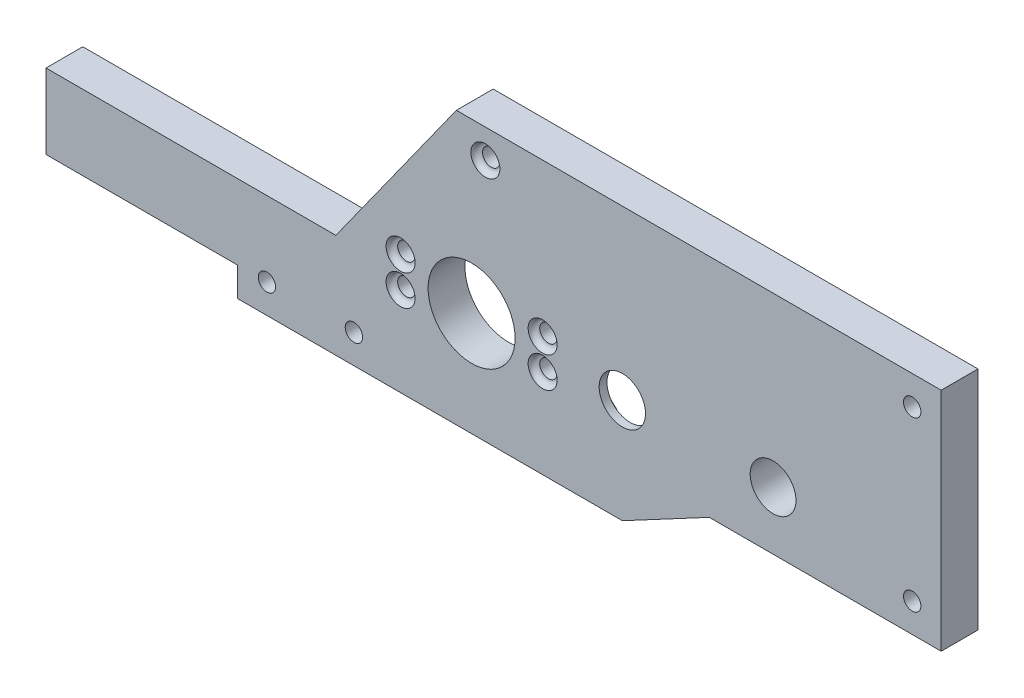
ISO-10303-21;
HEADER;
FILE_DESCRIPTION(('STEP AP214'),'2;1');
FILE_NAME('part.step','',(''),(''),'','','');
FILE_SCHEMA(('AUTOMOTIVE_DESIGN { 1 0 10303 214 1 1 1 1 }'));
ENDSEC;
DATA;
#1=APPLICATION_CONTEXT('core data for automotive mechanical design processes');
#2=APPLICATION_PROTOCOL_DEFINITION('international standard','automotive_design',2000,#1);
#3=PRODUCT_CONTEXT('',#1,'mechanical');
#4=PRODUCT('Part','Part','',(#3));
#5=PRODUCT_RELATED_PRODUCT_CATEGORY('part','',(#4));
#6=PRODUCT_DEFINITION_FORMATION('','',#4);
#7=PRODUCT_DEFINITION_CONTEXT('part definition',#1,'design');
#8=PRODUCT_DEFINITION('design','',#6,#7);
#9=PRODUCT_DEFINITION_SHAPE('','',#8);
#10=(LENGTH_UNIT() NAMED_UNIT(*) SI_UNIT(.MILLI.,.METRE.));
#11=(NAMED_UNIT(*) PLANE_ANGLE_UNIT() SI_UNIT($,.RADIAN.));
#12=(NAMED_UNIT(*) SI_UNIT($,.STERADIAN.) SOLID_ANGLE_UNIT());
#13=UNCERTAINTY_MEASURE_WITH_UNIT(LENGTH_MEASURE(1.E-05),#10,'distance_accuracy_value','');
#14=(GEOMETRIC_REPRESENTATION_CONTEXT(3) GLOBAL_UNCERTAINTY_ASSIGNED_CONTEXT((#13)) GLOBAL_UNIT_ASSIGNED_CONTEXT((#10,
#11,#12)) REPRESENTATION_CONTEXT('',''));
#15=CARTESIAN_POINT('',(0.,0.,0.));
#16=DIRECTION('',(0.,0.,1.));
#17=DIRECTION('',(1.,0.,0.));
#18=AXIS2_PLACEMENT_3D('',#15,#16,#17);
#19=CARTESIAN_POINT('',(0.,0.,6.35));
#20=DIRECTION('',(0.,0.,-1.));
#21=DIRECTION('',(-1.,0.,0.));
#22=AXIS2_PLACEMENT_3D('',#19,#20,#21);
#23=PLANE('',#22);
#24=CARTESIAN_POINT('',(54.2345719771094,0.778451522678827,6.35));
#25=DIRECTION('',(0.,0.,-1.));
#26=DIRECTION('',(-1.,0.,0.));
#27=AXIS2_PLACEMENT_3D('',#24,#25,#26);
#28=CIRCLE('',#27,4.00000000000001);
#29=CARTESIAN_POINT('',(50.2345719771094,0.778451522678827,6.35));
#30=VERTEX_POINT('',#29);
#31=EDGE_CURVE('E374',#30,#30,#28,.F.);
#32=ORIENTED_EDGE('',*,*,#31,.F.);
#33=EDGE_LOOP('',(#32));
#34=FACE_BOUND('',#33,.T.);
#35=CARTESIAN_POINT('',(30.6108482559838,24.7784515226788,6.35));
#36=DIRECTION('',(0.,0.,-1.));
#37=DIRECTION('',(-1.,0.,0.));
#38=AXIS2_PLACEMENT_3D('',#35,#36,#37);
#39=CIRCLE('',#38,2.5);
#40=CARTESIAN_POINT('',(33.1108482559838,24.7784515226788,6.35));
#41=VERTEX_POINT('',#40);
#42=EDGE_CURVE('E369',#41,#41,#39,.T.);
#43=ORIENTED_EDGE('',*,*,#42,.T.);
#44=EDGE_LOOP('',(#43));
#45=FACE_BOUND('',#44,.T.);
#46=CARTESIAN_POINT('',(40.4845719771094,-1.87154847732117,6.35));
#47=DIRECTION('',(0.,0.,-1.));
#48=DIRECTION('',(-1.,0.,0.));
#49=AXIS2_PLACEMENT_3D('',#46,#47,#48);
#50=CIRCLE('',#49,2.5);
#51=CARTESIAN_POINT('',(37.9845719771095,-1.87154847732117,6.35));
#52=VERTEX_POINT('',#51);
#53=EDGE_CURVE('E364',#52,#52,#50,.T.);
#54=ORIENTED_EDGE('',*,*,#53,.T.);
#55=EDGE_LOOP('',(#54));
#56=FACE_BOUND('',#55,.T.);
#57=CARTESIAN_POINT('',(40.4845719771094,3.42845152267883,6.35));
#58=DIRECTION('',(0.,0.,-1.));
#59=DIRECTION('',(-1.,0.,0.));
#60=AXIS2_PLACEMENT_3D('',#57,#58,#59);
#61=CIRCLE('',#60,2.5);
#62=CARTESIAN_POINT('',(42.9845719771094,3.42845152267883,6.35));
#63=VERTEX_POINT('',#62);
#64=EDGE_CURVE('E359',#63,#63,#61,.T.);
#65=ORIENTED_EDGE('',*,*,#64,.T.);
#66=EDGE_LOOP('',(#65));
#67=FACE_BOUND('',#66,.T.);
#68=CARTESIAN_POINT('',(15.9845719771095,-1.87154847732117,6.35));
#69=DIRECTION('',(0.,0.,-1.));
#70=DIRECTION('',(-1.,0.,0.));
#71=AXIS2_PLACEMENT_3D('',#68,#69,#70);
#72=CIRCLE('',#71,2.5);
#73=CARTESIAN_POINT('',(18.4845719771095,-1.87154847732117,6.35));
#74=VERTEX_POINT('',#73);
#75=EDGE_CURVE('E354',#74,#74,#72,.T.);
#76=ORIENTED_EDGE('',*,*,#75,.T.);
#77=EDGE_LOOP('',(#76));
#78=FACE_BOUND('',#77,.T.);
#79=CARTESIAN_POINT('',(15.9845719771094,3.42845152267883,6.35));
#80=DIRECTION('',(0.,0.,-1.));
#81=DIRECTION('',(-1.,0.,0.));
#82=AXIS2_PLACEMENT_3D('',#79,#80,#81);
#83=CIRCLE('',#82,2.5);
#84=CARTESIAN_POINT('',(13.4845719771094,3.42845152267883,6.35));
#85=VERTEX_POINT('',#84);
#86=EDGE_CURVE('E347',#85,#85,#83,.T.);
#87=ORIENTED_EDGE('',*,*,#86,.T.);
#88=EDGE_LOOP('',(#87));
#89=FACE_BOUND('',#88,.T.);
#90=DIRECTION('',(-1.,0.,0.));
#91=VECTOR('',#90,1.);
#92=CARTESIAN_POINT('',(-45.1763097710235,-12.2215484773212,6.35));
#93=LINE('',#92,#91);
#94=CARTESIAN_POINT('',(-12.1763097710235,-12.2215484773212,6.35));
#95=VERTEX_POINT('',#94);
#96=CARTESIAN_POINT('',(-45.1763097710235,-12.2215484773212,6.35));
#97=VERTEX_POINT('',#96);
#98=EDGE_CURVE('E153',#95,#97,#93,.T.);
#99=ORIENTED_EDGE('',*,*,#98,.F.);
#100=DIRECTION('',(0.,1.,0.));
#101=VECTOR('',#100,1.);
#102=CARTESIAN_POINT('',(-12.1763097710235,-17.2215484773212,6.35));
#103=LINE('',#102,#101);
#104=CARTESIAN_POINT('',(-12.1763097710235,-17.2215484773212,6.35));
#105=VERTEX_POINT('',#104);
#106=EDGE_CURVE('E168',#105,#95,#103,.T.);
#107=ORIENTED_EDGE('',*,*,#106,.F.);
#108=DIRECTION('',(1.,0.,0.));
#109=VECTOR('',#108,1.);
#110=CARTESIAN_POINT('',(-45.1763097710235,-17.2215484773212,6.35));
#111=LINE('',#110,#109);
#112=CARTESIAN_POINT('',(54.2345719771095,-17.2215484773212,6.35));
#113=VERTEX_POINT('',#112);
#114=EDGE_CURVE('E174',#105,#113,#111,.T.);
#115=ORIENTED_EDGE('',*,*,#114,.T.);
#116=DIRECTION('',(0.882352941176471,0.470588235294117,0.));
#117=VECTOR('',#116,1.);
#118=CARTESIAN_POINT('',(54.2345719771095,-17.2215484773212,6.35));
#119=LINE('',#118,#117);
#120=CARTESIAN_POINT('',(69.2345719771095,-9.22154847732117,6.35));
#121=VERTEX_POINT('',#120);
#122=EDGE_CURVE('E177',#113,#121,#119,.T.);
#123=ORIENTED_EDGE('',*,*,#122,.T.);
#124=DIRECTION('',(1.,0.,0.));
#125=VECTOR('',#124,1.);
#126=CARTESIAN_POINT('',(69.2345719771095,-9.22154847732117,6.35));
#127=LINE('',#126,#125);
#128=CARTESIAN_POINT('',(109.234571977109,-9.22154847732117,6.35));
#129=VERTEX_POINT('',#128);
#130=EDGE_CURVE('E282',#121,#129,#127,.T.);
#131=ORIENTED_EDGE('',*,*,#130,.T.);
#132=DIRECTION('',(0.,1.,0.));
#133=VECTOR('',#132,1.);
#134=CARTESIAN_POINT('',(109.234571977109,29.7784515226788,6.35));
#135=LINE('',#134,#133);
#136=CARTESIAN_POINT('',(109.234571977109,29.7784515226788,6.35));
#137=VERTEX_POINT('',#136);
#138=EDGE_CURVE('E284',#129,#137,#135,.T.);
#139=ORIENTED_EDGE('',*,*,#138,.T.);
#140=DIRECTION('',(-1.,0.,0.));
#141=VECTOR('',#140,1.);
#142=CARTESIAN_POINT('',(109.234571977109,29.7784515226788,6.35));
#143=LINE('',#142,#141);
#144=CARTESIAN_POINT('',(25.6108482559838,29.7784515226788,6.35));
#145=VERTEX_POINT('',#144);
#146=EDGE_CURVE('E286',#137,#145,#143,.T.);
#147=ORIENTED_EDGE('',*,*,#146,.T.);
#148=DIRECTION('',(-0.581572960127056,-0.813494248319589,0.));
#149=VECTOR('',#148,1.);
#150=CARTESIAN_POINT('',(25.6108482559838,29.7784515226788,6.35));
#151=LINE('',#150,#149);
#152=CARTESIAN_POINT('',(4.8236902289765,0.701732601313472,6.35));
#153=VERTEX_POINT('',#152);
#154=EDGE_CURVE('E288',#145,#153,#151,.T.);
#155=ORIENTED_EDGE('',*,*,#154,.T.);
#156=DIRECTION('',(-1.,0.,0.));
#157=VECTOR('',#156,1.);
#158=CARTESIAN_POINT('',(4.8236902289765,0.701732601313472,6.35));
#159=LINE('',#158,#157);
#160=CARTESIAN_POINT('',(-45.1763097710235,0.701732601313444,6.35));
#161=VERTEX_POINT('',#160);
#162=EDGE_CURVE('E290',#153,#161,#159,.T.);
#163=ORIENTED_EDGE('',*,*,#162,.T.);
#164=DIRECTION('',(0.,-1.,0.));
#165=VECTOR('',#164,1.);
#166=CARTESIAN_POINT('',(-45.1763097710235,0.701732601313444,6.35));
#167=LINE('',#166,#165);
#168=EDGE_CURVE('E185',#161,#97,#167,.T.);
#169=ORIENTED_EDGE('',*,*,#168,.T.);
#170=EDGE_LOOP('',(#99,#107,#115,#123,#131,#139,#147,#155,#163,#169));
#171=FACE_BOUND('',#170,.T.);
#172=CARTESIAN_POINT('',(28.2345719771095,0.77845152267883,6.35));
#173=DIRECTION('',(0.,0.,1.));
#174=DIRECTION('',(1.,0.,0.));
#175=AXIS2_PLACEMENT_3D('',#172,#173,#174);
#176=CIRCLE('',#175,7.5);
#177=CARTESIAN_POINT('',(35.7345719771094,0.77845152267883,6.35));
#178=VERTEX_POINT('',#177);
#179=EDGE_CURVE('E275',#178,#178,#176,.T.);
#180=ORIENTED_EDGE('',*,*,#179,.F.);
#181=EDGE_LOOP('',(#180));
#182=FACE_BOUND('',#181,.T.);
#183=CARTESIAN_POINT('',(-7.06690539482761,-12.2215484773212,6.35));
#184=DIRECTION('',(0.,0.,1.));
#185=DIRECTION('',(1.,0.,0.));
#186=AXIS2_PLACEMENT_3D('',#183,#184,#185);
#187=CIRCLE('',#186,1.5);
#188=CARTESIAN_POINT('',(-5.56690539482761,-12.2215484773212,6.35));
#189=VERTEX_POINT('',#188);
#190=EDGE_CURVE('E266',#189,#189,#187,.T.);
#191=ORIENTED_EDGE('',*,*,#190,.F.);
#192=EDGE_LOOP('',(#191));
#193=FACE_BOUND('',#192,.T.);
#194=CARTESIAN_POINT('',(80.2345719771095,0.77845152267883,6.35));
#195=DIRECTION('',(0.,0.,1.));
#196=DIRECTION('',(1.,0.,0.));
#197=AXIS2_PLACEMENT_3D('',#194,#195,#196);
#198=CIRCLE('',#197,3.95);
#199=CARTESIAN_POINT('',(84.1845719771094,0.77845152267883,6.35));
#200=VERTEX_POINT('',#199);
#201=EDGE_CURVE('E251',#200,#200,#198,.T.);
#202=ORIENTED_EDGE('',*,*,#201,.F.);
#203=EDGE_LOOP('',(#202));
#204=FACE_BOUND('',#203,.T.);
#205=CARTESIAN_POINT('',(7.93309460517241,-12.2215484773212,6.35));
#206=DIRECTION('',(0.,0.,1.));
#207=DIRECTION('',(1.,0.,0.));
#208=AXIS2_PLACEMENT_3D('',#205,#206,#207);
#209=CIRCLE('',#208,1.5);
#210=CARTESIAN_POINT('',(9.43309460517241,-12.2215484773212,6.35));
#211=VERTEX_POINT('',#210);
#212=EDGE_CURVE('E247',#211,#211,#209,.T.);
#213=ORIENTED_EDGE('',*,*,#212,.F.);
#214=EDGE_LOOP('',(#213));
#215=FACE_BOUND('',#214,.T.);
#216=CARTESIAN_POINT('',(104.234571977109,24.7784515226788,6.35));
#217=DIRECTION('',(0.,0.,1.));
#218=DIRECTION('',(1.,0.,0.));
#219=AXIS2_PLACEMENT_3D('',#216,#217,#218);
#220=CIRCLE('',#219,1.5);
#221=CARTESIAN_POINT('',(105.734571977109,24.7784515226788,6.35));
#222=VERTEX_POINT('',#221);
#223=EDGE_CURVE('E237',#222,#222,#220,.T.);
#224=ORIENTED_EDGE('',*,*,#223,.F.);
#225=EDGE_LOOP('',(#224));
#226=FACE_BOUND('',#225,.T.);
#227=CARTESIAN_POINT('',(104.234571977109,-4.22154847732117,6.35));
#228=DIRECTION('',(0.,0.,1.));
#229=DIRECTION('',(1.,0.,0.));
#230=AXIS2_PLACEMENT_3D('',#227,#228,#229);
#231=CIRCLE('',#230,1.5);
#232=CARTESIAN_POINT('',(105.734571977109,-4.22154847732117,6.35));
#233=VERTEX_POINT('',#232);
#234=EDGE_CURVE('E232',#233,#233,#231,.T.);
#235=ORIENTED_EDGE('',*,*,#234,.F.);
#236=EDGE_LOOP('',(#235));
#237=FACE_BOUND('',#236,.T.);
#238=ADVANCED_FACE('F33',(#34,#45,#56,#67,#78,#89,#171,#182,#193,#204,#215,#226,#237),#23,.F.);
#239=CARTESIAN_POINT('',(0.,0.,0.));
#240=DIRECTION('',(0.,0.,-1.));
#241=DIRECTION('',(-1.,0.,0.));
#242=AXIS2_PLACEMENT_3D('',#239,#240,#241);
#243=PLANE('',#242);
#244=CARTESIAN_POINT('',(7.93309460517241,-12.2215484773212,0.));
#245=DIRECTION('',(0.,0.,-1.));
#246=DIRECTION('',(-1.,0.,0.));
#247=AXIS2_PLACEMENT_3D('',#244,#245,#246);
#248=CIRCLE('',#247,2.5);
#249=CARTESIAN_POINT('',(10.4330946051724,-12.2215484773212,0.));
#250=VERTEX_POINT('',#249);
#251=EDGE_CURVE('E383',#250,#250,#248,.T.);
#252=ORIENTED_EDGE('',*,*,#251,.F.);
#253=EDGE_LOOP('',(#252));
#254=FACE_BOUND('',#253,.T.);
#255=CARTESIAN_POINT('',(104.234571977109,-4.22154847732117,0.));
#256=DIRECTION('',(0.,0.,-1.));
#257=DIRECTION('',(-1.,0.,0.));
#258=AXIS2_PLACEMENT_3D('',#255,#256,#257);
#259=CIRCLE('',#258,2.5);
#260=CARTESIAN_POINT('',(106.734571977109,-4.22154847732117,0.));
#261=VERTEX_POINT('',#260);
#262=EDGE_CURVE('E380',#261,#261,#259,.T.);
#263=ORIENTED_EDGE('',*,*,#262,.F.);
#264=EDGE_LOOP('',(#263));
#265=FACE_BOUND('',#264,.T.);
#266=CARTESIAN_POINT('',(54.2345719771094,0.778451522678827,0.));
#267=DIRECTION('',(0.,0.,-1.));
#268=DIRECTION('',(-1.,0.,0.));
#269=AXIS2_PLACEMENT_3D('',#266,#267,#268);
#270=CIRCLE('',#269,11.);
#271=CARTESIAN_POINT('',(43.2345719771094,0.778451522678827,0.));
#272=VERTEX_POINT('',#271);
#273=EDGE_CURVE('E344',#272,#272,#270,.T.);
#274=ORIENTED_EDGE('',*,*,#273,.F.);
#275=EDGE_LOOP('',(#274));
#276=FACE_BOUND('',#275,.T.);
#277=DIRECTION('',(0.,-1.,0.));
#278=VECTOR('',#277,1.);
#279=CARTESIAN_POINT('',(-12.1763097710235,-17.2215484773212,0.));
#280=LINE('',#279,#278);
#281=CARTESIAN_POINT('',(-12.1763097710235,-12.2215484773212,0.));
#282=VERTEX_POINT('',#281);
#283=CARTESIAN_POINT('',(-12.1763097710235,-17.2215484773212,0.));
#284=VERTEX_POINT('',#283);
#285=EDGE_CURVE('E159',#282,#284,#280,.T.);
#286=ORIENTED_EDGE('',*,*,#285,.F.);
#287=DIRECTION('',(1.,0.,0.));
#288=VECTOR('',#287,1.);
#289=CARTESIAN_POINT('',(-45.1763097710235,-12.2215484773212,0.));
#290=LINE('',#289,#288);
#291=CARTESIAN_POINT('',(-45.1763097710235,-12.2215484773212,0.));
#292=VERTEX_POINT('',#291);
#293=EDGE_CURVE('E150',#292,#282,#290,.T.);
#294=ORIENTED_EDGE('',*,*,#293,.F.);
#295=DIRECTION('',(0.,-1.,0.));
#296=VECTOR('',#295,1.);
#297=CARTESIAN_POINT('',(-45.1763097710235,0.701732601313444,0.));
#298=LINE('',#297,#296);
#299=CARTESIAN_POINT('',(-45.1763097710235,0.701732601313444,0.));
#300=VERTEX_POINT('',#299);
#301=EDGE_CURVE('E166',#300,#292,#298,.T.);
#302=ORIENTED_EDGE('',*,*,#301,.F.);
#303=DIRECTION('',(-1.,0.,0.));
#304=VECTOR('',#303,1.);
#305=CARTESIAN_POINT('',(4.8236902289765,0.701732601313472,0.));
#306=LINE('',#305,#304);
#307=CARTESIAN_POINT('',(4.8236902289765,0.701732601313472,0.));
#308=VERTEX_POINT('',#307);
#309=EDGE_CURVE('E175',#308,#300,#306,.T.);
#310=ORIENTED_EDGE('',*,*,#309,.F.);
#311=DIRECTION('',(-0.581572960127056,-0.813494248319589,0.));
#312=VECTOR('',#311,1.);
#313=CARTESIAN_POINT('',(25.6108482559838,29.7784515226788,0.));
#314=LINE('',#313,#312);
#315=CARTESIAN_POINT('',(25.6108482559838,29.7784515226788,0.));
#316=VERTEX_POINT('',#315);
#317=EDGE_CURVE('E179',#316,#308,#314,.T.);
#318=ORIENTED_EDGE('',*,*,#317,.F.);
#319=DIRECTION('',(-1.,0.,0.));
#320=VECTOR('',#319,1.);
#321=CARTESIAN_POINT('',(109.234571977109,29.7784515226788,0.));
#322=LINE('',#321,#320);
#323=CARTESIAN_POINT('',(109.234571977109,29.7784515226788,0.));
#324=VERTEX_POINT('',#323);
#325=EDGE_CURVE('E300',#324,#316,#322,.T.);
#326=ORIENTED_EDGE('',*,*,#325,.F.);
#327=DIRECTION('',(0.,1.,0.));
#328=VECTOR('',#327,1.);
#329=CARTESIAN_POINT('',(109.234571977109,29.7784515226788,0.));
#330=LINE('',#329,#328);
#331=CARTESIAN_POINT('',(109.234571977109,-9.22154847732117,0.));
#332=VERTEX_POINT('',#331);
#333=EDGE_CURVE('E298',#332,#324,#330,.T.);
#334=ORIENTED_EDGE('',*,*,#333,.F.);
#335=DIRECTION('',(1.,0.,0.));
#336=VECTOR('',#335,1.);
#337=CARTESIAN_POINT('',(69.2345719771095,-9.22154847732117,0.));
#338=LINE('',#337,#336);
#339=CARTESIAN_POINT('',(69.2345719771095,-9.22154847732117,0.));
#340=VERTEX_POINT('',#339);
#341=EDGE_CURVE('E296',#340,#332,#338,.T.);
#342=ORIENTED_EDGE('',*,*,#341,.F.);
#343=DIRECTION('',(0.882352941176471,0.470588235294117,0.));
#344=VECTOR('',#343,1.);
#345=CARTESIAN_POINT('',(54.2345719771095,-17.2215484773212,0.));
#346=LINE('',#345,#344);
#347=CARTESIAN_POINT('',(54.2345719771095,-17.2215484773212,0.));
#348=VERTEX_POINT('',#347);
#349=EDGE_CURVE('E294',#348,#340,#346,.T.);
#350=ORIENTED_EDGE('',*,*,#349,.F.);
#351=DIRECTION('',(1.,0.,0.));
#352=VECTOR('',#351,1.);
#353=CARTESIAN_POINT('',(28.2345719771095,-17.2215484773212,0.));
#354=LINE('',#353,#352);
#355=EDGE_CURVE('E278',#284,#348,#354,.T.);
#356=ORIENTED_EDGE('',*,*,#355,.F.);
#357=EDGE_LOOP('',(#286,#294,#302,#310,#318,#326,#334,#342,#350,#356));
#358=FACE_BOUND('',#357,.T.);
#359=CARTESIAN_POINT('',(104.234571977109,24.7784515226788,0.));
#360=DIRECTION('',(0.,0.,1.));
#361=DIRECTION('',(1.,0.,0.));
#362=AXIS2_PLACEMENT_3D('',#359,#360,#361);
#363=CIRCLE('',#362,1.5);
#364=CARTESIAN_POINT('',(105.734571977109,24.7784515226788,0.));
#365=VERTEX_POINT('',#364);
#366=EDGE_CURVE('E234',#365,#365,#363,.T.);
#367=ORIENTED_EDGE('',*,*,#366,.T.);
#368=EDGE_LOOP('',(#367));
#369=FACE_BOUND('',#368,.T.);
#370=CARTESIAN_POINT('',(15.9845719771094,3.42845152267883,0.));
#371=DIRECTION('',(0.,0.,1.));
#372=DIRECTION('',(-1.,0.,0.));
#373=AXIS2_PLACEMENT_3D('',#370,#371,#372);
#374=CIRCLE('',#373,1.5);
#375=CARTESIAN_POINT('',(14.4845719771094,3.42845152267883,0.));
#376=VERTEX_POINT('',#375);
#377=EDGE_CURVE('E254',#376,#376,#374,.T.);
#378=ORIENTED_EDGE('',*,*,#377,.T.);
#379=EDGE_LOOP('',(#378));
#380=FACE_BOUND('',#379,.T.);
#381=CARTESIAN_POINT('',(40.4845719771094,-1.87154847732117,0.));
#382=DIRECTION('',(0.,0.,1.));
#383=DIRECTION('',(-1.,0.,0.));
#384=AXIS2_PLACEMENT_3D('',#381,#382,#383);
#385=CIRCLE('',#384,1.5);
#386=CARTESIAN_POINT('',(38.9845719771095,-1.87154847732117,0.));
#387=VERTEX_POINT('',#386);
#388=EDGE_CURVE('E262',#387,#387,#385,.T.);
#389=ORIENTED_EDGE('',*,*,#388,.T.);
#390=EDGE_LOOP('',(#389));
#391=FACE_BOUND('',#390,.T.);
#392=CARTESIAN_POINT('',(40.4845719771094,3.42845152267883,0.));
#393=DIRECTION('',(0.,0.,1.));
#394=DIRECTION('',(1.,0.,0.));
#395=AXIS2_PLACEMENT_3D('',#392,#393,#394);
#396=CIRCLE('',#395,1.5);
#397=CARTESIAN_POINT('',(41.9845719771094,3.42845152267883,0.));
#398=VERTEX_POINT('',#397);
#399=EDGE_CURVE('E269',#398,#398,#396,.T.);
#400=ORIENTED_EDGE('',*,*,#399,.T.);
#401=EDGE_LOOP('',(#400));
#402=FACE_BOUND('',#401,.T.);
#403=CARTESIAN_POINT('',(28.2345719771095,0.77845152267883,0.));
#404=DIRECTION('',(0.,0.,1.));
#405=DIRECTION('',(1.,0.,0.));
#406=AXIS2_PLACEMENT_3D('',#403,#404,#405);
#407=CIRCLE('',#406,7.5);
#408=CARTESIAN_POINT('',(35.7345719771094,0.77845152267883,0.));
#409=VERTEX_POINT('',#408);
#410=EDGE_CURVE('E274',#409,#409,#407,.T.);
#411=ORIENTED_EDGE('',*,*,#410,.T.);
#412=EDGE_LOOP('',(#411));
#413=FACE_BOUND('',#412,.T.);
#414=CARTESIAN_POINT('',(-7.06690539482761,-12.2215484773212,0.));
#415=DIRECTION('',(0.,0.,1.));
#416=DIRECTION('',(1.,0.,0.));
#417=AXIS2_PLACEMENT_3D('',#414,#415,#416);
#418=CIRCLE('',#417,1.5);
#419=CARTESIAN_POINT('',(-5.56690539482761,-12.2215484773212,0.));
#420=VERTEX_POINT('',#419);
#421=EDGE_CURVE('E265',#420,#420,#418,.T.);
#422=ORIENTED_EDGE('',*,*,#421,.T.);
#423=EDGE_LOOP('',(#422));
#424=FACE_BOUND('',#423,.T.);
#425=CARTESIAN_POINT('',(15.9845719771095,-1.87154847732117,0.));
#426=DIRECTION('',(0.,0.,1.));
#427=DIRECTION('',(1.,0.,0.));
#428=AXIS2_PLACEMENT_3D('',#425,#426,#427);
#429=CIRCLE('',#428,1.5);
#430=CARTESIAN_POINT('',(17.4845719771095,-1.87154847732117,0.));
#431=VERTEX_POINT('',#430);
#432=EDGE_CURVE('E259',#431,#431,#429,.T.);
#433=ORIENTED_EDGE('',*,*,#432,.T.);
#434=EDGE_LOOP('',(#433));
#435=FACE_BOUND('',#434,.T.);
#436=CARTESIAN_POINT('',(80.2345719771095,0.77845152267883,0.));
#437=DIRECTION('',(0.,0.,1.));
#438=DIRECTION('',(1.,0.,0.));
#439=AXIS2_PLACEMENT_3D('',#436,#437,#438);
#440=CIRCLE('',#439,3.95);
#441=CARTESIAN_POINT('',(84.1845719771094,0.77845152267883,0.));
#442=VERTEX_POINT('',#441);
#443=EDGE_CURVE('E250',#442,#442,#440,.T.);
#444=ORIENTED_EDGE('',*,*,#443,.T.);
#445=EDGE_LOOP('',(#444));
#446=FACE_BOUND('',#445,.T.);
#447=CARTESIAN_POINT('',(30.6108482559838,24.7784515226788,0.));
#448=DIRECTION('',(0.,0.,1.));
#449=DIRECTION('',(1.,0.,0.));
#450=AXIS2_PLACEMENT_3D('',#447,#448,#449);
#451=CIRCLE('',#450,1.5);
#452=CARTESIAN_POINT('',(32.1108482559838,24.7784515226788,0.));
#453=VERTEX_POINT('',#452);
#454=EDGE_CURVE('E243',#453,#453,#451,.T.);
#455=ORIENTED_EDGE('',*,*,#454,.T.);
#456=EDGE_LOOP('',(#455));
#457=FACE_BOUND('',#456,.T.);
#458=ADVANCED_FACE('F163',(#254,#265,#276,#358,#369,#380,#391,#402,#413,#424,#435,#446,#457),
#243,.T.);
#459=CARTESIAN_POINT('',(28.2345719771095,-17.2215484773212,6.35));
#460=DIRECTION('',(0.,1.,0.));
#461=DIRECTION('',(-1.,0.,0.));
#462=AXIS2_PLACEMENT_3D('',#459,#460,#461);
#463=PLANE('',#462);
#464=ORIENTED_EDGE('',*,*,#114,.F.);
#465=DIRECTION('',(0.,0.,-1.));
#466=VECTOR('',#465,1.);
#467=CARTESIAN_POINT('',(-12.1763097710235,-17.2215484773212,6.351));
#468=LINE('',#467,#466);
#469=EDGE_CURVE('E239',#105,#284,#468,.T.);
#470=ORIENTED_EDGE('',*,*,#469,.T.);
#471=ORIENTED_EDGE('',*,*,#355,.T.);
#472=DIRECTION('',(0.,0.,-1.));
#473=VECTOR('',#472,1.);
#474=CARTESIAN_POINT('',(54.2345719771095,-17.2215484773212,6.35));
#475=LINE('',#474,#473);
#476=EDGE_CURVE('E200',#113,#348,#475,.T.);
#477=ORIENTED_EDGE('',*,*,#476,.F.);
#478=EDGE_LOOP('',(#464,#470,#471,#477));
#479=FACE_BOUND('',#478,.T.);
#480=ADVANCED_FACE('F35',(#479),#463,.F.);
#481=CARTESIAN_POINT('',(54.2345719771095,-17.2215484773212,6.35));
#482=DIRECTION('',(-0.470588235294117,0.882352941176471,0.));
#483=DIRECTION('',(-0.882352941176471,-0.470588235294117,0.));
#484=AXIS2_PLACEMENT_3D('',#481,#482,#483);
#485=PLANE('',#484);
#486=ORIENTED_EDGE('',*,*,#349,.T.);
#487=DIRECTION('',(0.,0.,-1.));
#488=VECTOR('',#487,1.);
#489=CARTESIAN_POINT('',(69.2345719771095,-9.22154847732117,6.35));
#490=LINE('',#489,#488);
#491=EDGE_CURVE('E197',#121,#340,#490,.T.);
#492=ORIENTED_EDGE('',*,*,#491,.F.);
#493=ORIENTED_EDGE('',*,*,#122,.F.);
#494=ORIENTED_EDGE('',*,*,#476,.T.);
#495=EDGE_LOOP('',(#486,#492,#493,#494));
#496=FACE_BOUND('',#495,.T.);
#497=ADVANCED_FACE('F330',(#496),#485,.F.);
#498=CARTESIAN_POINT('',(69.2345719771095,-9.22154847732117,6.35));
#499=DIRECTION('',(0.,1.,0.));
#500=DIRECTION('',(0.,0.,1.));
#501=AXIS2_PLACEMENT_3D('',#498,#499,#500);
#502=PLANE('',#501);
#503=ORIENTED_EDGE('',*,*,#341,.T.);
#504=DIRECTION('',(0.,0.,-1.));
#505=VECTOR('',#504,1.);
#506=CARTESIAN_POINT('',(109.234571977109,-9.22154847732117,6.35));
#507=LINE('',#506,#505);
#508=EDGE_CURVE('E194',#129,#332,#507,.T.);
#509=ORIENTED_EDGE('',*,*,#508,.F.);
#510=ORIENTED_EDGE('',*,*,#130,.F.);
#511=ORIENTED_EDGE('',*,*,#491,.T.);
#512=EDGE_LOOP('',(#503,#509,#510,#511));
#513=FACE_BOUND('',#512,.T.);
#514=ADVANCED_FACE('F326',(#513),#502,.F.);
#515=CARTESIAN_POINT('',(109.234571977109,29.7784515226788,6.35));
#516=DIRECTION('',(-1.,0.,0.));
#517=DIRECTION('',(0.,-1.,0.));
#518=AXIS2_PLACEMENT_3D('',#515,#516,#517);
#519=PLANE('',#518);
#520=ORIENTED_EDGE('',*,*,#333,.T.);
#521=DIRECTION('',(0.,0.,-1.));
#522=VECTOR('',#521,1.);
#523=CARTESIAN_POINT('',(109.234571977109,29.7784515226788,6.35));
#524=LINE('',#523,#522);
#525=EDGE_CURVE('E191',#137,#324,#524,.T.);
#526=ORIENTED_EDGE('',*,*,#525,.F.);
#527=ORIENTED_EDGE('',*,*,#138,.F.);
#528=ORIENTED_EDGE('',*,*,#508,.T.);
#529=EDGE_LOOP('',(#520,#526,#527,#528));
#530=FACE_BOUND('',#529,.T.);
#531=ADVANCED_FACE('F322',(#530),#519,.F.);
#532=CARTESIAN_POINT('',(109.234571977109,29.7784515226788,6.35));
#533=DIRECTION('',(0.,-1.,0.));
#534=DIRECTION('',(1.,0.,0.));
#535=AXIS2_PLACEMENT_3D('',#532,#533,#534);
#536=PLANE('',#535);
#537=ORIENTED_EDGE('',*,*,#325,.T.);
#538=DIRECTION('',(0.,0.,-1.));
#539=VECTOR('',#538,1.);
#540=CARTESIAN_POINT('',(25.6108482559838,29.7784515226788,6.35));
#541=LINE('',#540,#539);
#542=EDGE_CURVE('E188',#145,#316,#541,.T.);
#543=ORIENTED_EDGE('',*,*,#542,.F.);
#544=ORIENTED_EDGE('',*,*,#146,.F.);
#545=ORIENTED_EDGE('',*,*,#525,.T.);
#546=EDGE_LOOP('',(#537,#543,#544,#545));
#547=FACE_BOUND('',#546,.T.);
#548=ADVANCED_FACE('F317',(#547),#536,.F.);
#549=CARTESIAN_POINT('',(25.6108482559838,29.7784515226788,6.35));
#550=DIRECTION('',(0.813494248319589,-0.581572960127056,0.));
#551=DIRECTION('',(0.581572960127056,0.81349424831959,0.));
#552=AXIS2_PLACEMENT_3D('',#549,#550,#551);
#553=PLANE('',#552);
#554=ORIENTED_EDGE('',*,*,#317,.T.);
#555=DIRECTION('',(0.,0.,-1.));
#556=VECTOR('',#555,1.);
#557=CARTESIAN_POINT('',(4.8236902289765,0.701732601313472,6.35));
#558=LINE('',#557,#556);
#559=EDGE_CURVE('E184',#153,#308,#558,.T.);
#560=ORIENTED_EDGE('',*,*,#559,.F.);
#561=ORIENTED_EDGE('',*,*,#154,.F.);
#562=ORIENTED_EDGE('',*,*,#542,.T.);
#563=EDGE_LOOP('',(#554,#560,#561,#562));
#564=FACE_BOUND('',#563,.T.);
#565=ADVANCED_FACE('F304',(#564),#553,.F.);
#566=CARTESIAN_POINT('',(4.8236902289765,0.701732601313472,6.35));
#567=DIRECTION('',(0.,-1.,0.));
#568=DIRECTION('',(1.,0.,0.));
#569=AXIS2_PLACEMENT_3D('',#566,#567,#568);
#570=PLANE('',#569);
#571=ORIENTED_EDGE('',*,*,#309,.T.);
#572=DIRECTION('',(0.,0.,-1.));
#573=VECTOR('',#572,1.);
#574=CARTESIAN_POINT('',(-45.1763097710235,0.701732601313444,6.35));
#575=LINE('',#574,#573);
#576=EDGE_CURVE('E173',#161,#300,#575,.T.);
#577=ORIENTED_EDGE('',*,*,#576,.F.);
#578=ORIENTED_EDGE('',*,*,#162,.F.);
#579=ORIENTED_EDGE('',*,*,#559,.T.);
#580=EDGE_LOOP('',(#571,#577,#578,#579));
#581=FACE_BOUND('',#580,.T.);
#582=ADVANCED_FACE('F310',(#581),#570,.F.);
#583=CARTESIAN_POINT('',(-45.1763097710235,0.701732601313444,6.35));
#584=DIRECTION('',(1.,0.,0.));
#585=DIRECTION('',(0.,0.,-1.));
#586=AXIS2_PLACEMENT_3D('',#583,#584,#585);
#587=PLANE('',#586);
#588=ORIENTED_EDGE('',*,*,#301,.T.);
#589=DIRECTION('',(0.,0.,-1.));
#590=VECTOR('',#589,1.);
#591=CARTESIAN_POINT('',(-45.1763097710235,-12.2215484773212,6.351));
#592=LINE('',#591,#590);
#593=EDGE_CURVE('E147',#97,#292,#592,.T.);
#594=ORIENTED_EDGE('',*,*,#593,.F.);
#595=ORIENTED_EDGE('',*,*,#168,.F.);
#596=ORIENTED_EDGE('',*,*,#576,.T.);
#597=EDGE_LOOP('',(#588,#594,#595,#596));
#598=FACE_BOUND('',#597,.T.);
#599=ADVANCED_FACE('F171',(#598),#587,.F.);
#600=CARTESIAN_POINT('',(28.2345719771095,0.77845152267883,6.35));
#601=DIRECTION('',(0.,0.,-1.));
#602=DIRECTION('',(-1.,0.,0.));
#603=AXIS2_PLACEMENT_3D('',#600,#601,#602);
#604=CYLINDRICAL_SURFACE('',#603,7.5);
#605=ORIENTED_EDGE('',*,*,#179,.T.);
#606=EDGE_LOOP('',(#605));
#607=FACE_BOUND('',#606,.T.);
#608=ORIENTED_EDGE('',*,*,#410,.F.);
#609=EDGE_LOOP('',(#608));
#610=FACE_BOUND('',#609,.T.);
#611=ADVANCED_FACE('F418',(#607,#610),#604,.F.);
#612=CARTESIAN_POINT('',(40.4845719771094,3.42845152267883,6.35));
#613=DIRECTION('',(0.,0.,-1.));
#614=DIRECTION('',(-1.,0.,0.));
#615=AXIS2_PLACEMENT_3D('',#612,#613,#614);
#616=CYLINDRICAL_SURFACE('',#615,1.5);
#617=CARTESIAN_POINT('',(40.4845719771094,3.42845152267883,5.35));
#618=DIRECTION('',(0.,0.,1.));
#619=DIRECTION('',(1.,0.,0.));
#620=AXIS2_PLACEMENT_3D('',#617,#618,#619);
#621=CIRCLE('',#620,1.5);
#622=CARTESIAN_POINT('',(41.9845719771094,3.42845152267883,5.35));
#623=VERTEX_POINT('',#622);
#624=EDGE_CURVE('E209',#623,#623,#621,.F.);
#625=ORIENTED_EDGE('',*,*,#624,.F.);
#626=EDGE_LOOP('',(#625));
#627=FACE_BOUND('',#626,.T.);
#628=ORIENTED_EDGE('',*,*,#399,.F.);
#629=EDGE_LOOP('',(#628));
#630=FACE_BOUND('',#629,.T.);
#631=ADVANCED_FACE('F612',(#627,#630),#616,.F.);
#632=CARTESIAN_POINT('',(-7.06690539482761,-12.2215484773212,6.35));
#633=DIRECTION('',(0.,0.,-1.));
#634=DIRECTION('',(-1.,0.,0.));
#635=AXIS2_PLACEMENT_3D('',#632,#633,#634);
#636=CYLINDRICAL_SURFACE('',#635,1.5);
#637=ORIENTED_EDGE('',*,*,#190,.T.);
#638=EDGE_LOOP('',(#637));
#639=FACE_BOUND('',#638,.T.);
#640=ORIENTED_EDGE('',*,*,#421,.F.);
#641=EDGE_LOOP('',(#640));
#642=FACE_BOUND('',#641,.T.);
#643=ADVANCED_FACE('F609',(#639,#642),#636,.F.);
#644=CARTESIAN_POINT('',(40.4845719771094,-1.87154847732117,6.35));
#645=DIRECTION('',(0.,0.,-1.));
#646=DIRECTION('',(-1.,0.,0.));
#647=AXIS2_PLACEMENT_3D('',#644,#645,#646);
#648=CYLINDRICAL_SURFACE('',#647,1.5);
#649=CARTESIAN_POINT('',(40.4845719771094,-1.87154847732117,5.35));
#650=DIRECTION('',(0.,0.,1.));
#651=DIRECTION('',(1.,0.,0.));
#652=AXIS2_PLACEMENT_3D('',#649,#650,#651);
#653=CIRCLE('',#652,1.5);
#654=CARTESIAN_POINT('',(38.9845719771095,-1.87154847732117,5.35));
#655=VERTEX_POINT('',#654);
#656=EDGE_CURVE('E212',#655,#655,#653,.F.);
#657=ORIENTED_EDGE('',*,*,#656,.F.);
#658=EDGE_LOOP('',(#657));
#659=FACE_BOUND('',#658,.T.);
#660=ORIENTED_EDGE('',*,*,#388,.F.);
#661=EDGE_LOOP('',(#660));
#662=FACE_BOUND('',#661,.T.);
#663=ADVANCED_FACE('F605',(#659,#662),#648,.F.);
#664=CARTESIAN_POINT('',(15.9845719771095,-1.87154847732117,6.35));
#665=DIRECTION('',(0.,0.,-1.));
#666=DIRECTION('',(-1.,0.,0.));
#667=AXIS2_PLACEMENT_3D('',#664,#665,#666);
#668=CYLINDRICAL_SURFACE('',#667,1.5);
#669=CARTESIAN_POINT('',(15.9845719771095,-1.87154847732117,5.35));
#670=DIRECTION('',(0.,0.,1.));
#671=DIRECTION('',(1.,0.,0.));
#672=AXIS2_PLACEMENT_3D('',#669,#670,#671);
#673=CIRCLE('',#672,1.5);
#674=CARTESIAN_POINT('',(17.4845719771095,-1.87154847732117,5.35));
#675=VERTEX_POINT('',#674);
#676=EDGE_CURVE('E206',#675,#675,#673,.F.);
#677=ORIENTED_EDGE('',*,*,#676,.F.);
#678=EDGE_LOOP('',(#677));
#679=FACE_BOUND('',#678,.T.);
#680=ORIENTED_EDGE('',*,*,#432,.F.);
#681=EDGE_LOOP('',(#680));
#682=FACE_BOUND('',#681,.T.);
#683=ADVANCED_FACE('F601',(#679,#682),#668,.F.);
#684=CARTESIAN_POINT('',(15.9845719771094,3.42845152267883,6.35));
#685=DIRECTION('',(0.,0.,-1.));
#686=DIRECTION('',(-1.,0.,0.));
#687=AXIS2_PLACEMENT_3D('',#684,#685,#686);
#688=CYLINDRICAL_SURFACE('',#687,1.5);
#689=CARTESIAN_POINT('',(15.9845719771094,3.42845152267883,5.35));
#690=DIRECTION('',(0.,0.,1.));
#691=DIRECTION('',(1.,0.,0.));
#692=AXIS2_PLACEMENT_3D('',#689,#690,#691);
#693=CIRCLE('',#692,1.5);
#694=CARTESIAN_POINT('',(14.4845719771094,3.42845152267883,5.35));
#695=VERTEX_POINT('',#694);
#696=EDGE_CURVE('E203',#695,#695,#693,.F.);
#697=ORIENTED_EDGE('',*,*,#696,.F.);
#698=EDGE_LOOP('',(#697));
#699=FACE_BOUND('',#698,.T.);
#700=ORIENTED_EDGE('',*,*,#377,.F.);
#701=EDGE_LOOP('',(#700));
#702=FACE_BOUND('',#701,.T.);
#703=ADVANCED_FACE('F597',(#699,#702),#688,.F.);
#704=CARTESIAN_POINT('',(80.2345719771095,0.77845152267883,6.35));
#705=DIRECTION('',(0.,0.,-1.));
#706=DIRECTION('',(-1.,0.,0.));
#707=AXIS2_PLACEMENT_3D('',#704,#705,#706);
#708=CYLINDRICAL_SURFACE('',#707,3.95);
#709=ORIENTED_EDGE('',*,*,#201,.T.);
#710=EDGE_LOOP('',(#709));
#711=FACE_BOUND('',#710,.T.);
#712=ORIENTED_EDGE('',*,*,#443,.F.);
#713=EDGE_LOOP('',(#712));
#714=FACE_BOUND('',#713,.T.);
#715=ADVANCED_FACE('F462',(#711,#714),#708,.F.);
#716=CARTESIAN_POINT('',(7.93309460517241,-12.2215484773212,6.35));
#717=DIRECTION('',(0.,0.,-1.));
#718=DIRECTION('',(-1.,0.,0.));
#719=AXIS2_PLACEMENT_3D('',#716,#717,#718);
#720=CYLINDRICAL_SURFACE('',#719,1.5);
#721=CARTESIAN_POINT('',(7.93309460517241,-12.2215484773212,1.));
#722=DIRECTION('',(0.,0.,-1.));
#723=DIRECTION('',(-1.,0.,0.));
#724=AXIS2_PLACEMENT_3D('',#721,#722,#723);
#725=CIRCLE('',#724,1.5);
#726=CARTESIAN_POINT('',(9.43309460517241,-12.2215484773212,1.));
#727=VERTEX_POINT('',#726);
#728=EDGE_CURVE('E11',#727,#727,#725,.F.);
#729=ORIENTED_EDGE('',*,*,#728,.F.);
#730=EDGE_LOOP('',(#729));
#731=FACE_BOUND('',#730,.T.);
#732=ORIENTED_EDGE('',*,*,#212,.T.);
#733=EDGE_LOOP('',(#732));
#734=FACE_BOUND('',#733,.T.);
#735=ADVANCED_FACE('F456',(#731,#734),#720,.F.);
#736=CARTESIAN_POINT('',(30.6108482559838,24.7784515226788,6.35));
#737=DIRECTION('',(0.,0.,-1.));
#738=DIRECTION('',(-1.,0.,0.));
#739=AXIS2_PLACEMENT_3D('',#736,#737,#738);
#740=CYLINDRICAL_SURFACE('',#739,1.5);
#741=CARTESIAN_POINT('',(30.6108482559838,24.7784515226788,5.35));
#742=DIRECTION('',(0.,0.,1.));
#743=DIRECTION('',(1.,0.,0.));
#744=AXIS2_PLACEMENT_3D('',#741,#742,#743);
#745=CIRCLE('',#744,1.5);
#746=CARTESIAN_POINT('',(32.1108482559838,24.7784515226788,5.35));
#747=VERTEX_POINT('',#746);
#748=EDGE_CURVE('E215',#747,#747,#745,.F.);
#749=ORIENTED_EDGE('',*,*,#748,.F.);
#750=EDGE_LOOP('',(#749));
#751=FACE_BOUND('',#750,.T.);
#752=ORIENTED_EDGE('',*,*,#454,.F.);
#753=EDGE_LOOP('',(#752));
#754=FACE_BOUND('',#753,.T.);
#755=ADVANCED_FACE('F461',(#751,#754),#740,.F.);
#756=CARTESIAN_POINT('',(104.234571977109,24.7784515226788,6.35));
#757=DIRECTION('',(0.,0.,-1.));
#758=DIRECTION('',(-1.,0.,0.));
#759=AXIS2_PLACEMENT_3D('',#756,#757,#758);
#760=CYLINDRICAL_SURFACE('',#759,1.5);
#761=ORIENTED_EDGE('',*,*,#223,.T.);
#762=EDGE_LOOP('',(#761));
#763=FACE_BOUND('',#762,.T.);
#764=ORIENTED_EDGE('',*,*,#366,.F.);
#765=EDGE_LOOP('',(#764));
#766=FACE_BOUND('',#765,.T.);
#767=ADVANCED_FACE('F228',(#763,#766),#760,.F.);
#768=CARTESIAN_POINT('',(104.234571977109,-4.22154847732117,6.35));
#769=DIRECTION('',(0.,0.,-1.));
#770=DIRECTION('',(-1.,0.,0.));
#771=AXIS2_PLACEMENT_3D('',#768,#769,#770);
#772=CYLINDRICAL_SURFACE('',#771,1.5);
#773=CARTESIAN_POINT('',(104.234571977109,-4.22154847732117,1.));
#774=DIRECTION('',(0.,0.,-1.));
#775=DIRECTION('',(-1.,0.,0.));
#776=AXIS2_PLACEMENT_3D('',#773,#774,#775);
#777=CIRCLE('',#776,1.5);
#778=CARTESIAN_POINT('',(105.734571977109,-4.22154847732117,1.));
#779=VERTEX_POINT('',#778);
#780=EDGE_CURVE('E41',#779,#779,#777,.F.);
#781=ORIENTED_EDGE('',*,*,#780,.F.);
#782=EDGE_LOOP('',(#781));
#783=FACE_BOUND('',#782,.T.);
#784=ORIENTED_EDGE('',*,*,#234,.T.);
#785=EDGE_LOOP('',(#784));
#786=FACE_BOUND('',#785,.T.);
#787=ADVANCED_FACE('F224',(#783,#786),#772,.F.);
#788=CARTESIAN_POINT('',(-12.1763097710235,-17.2215484773212,6.351));
#789=DIRECTION('',(1.,0.,0.));
#790=DIRECTION('',(0.,0.,-1.));
#791=AXIS2_PLACEMENT_3D('',#788,#789,#790);
#792=PLANE('',#791);
#793=ORIENTED_EDGE('',*,*,#106,.T.);
#794=DIRECTION('',(0.,0.,-1.));
#795=VECTOR('',#794,1.);
#796=CARTESIAN_POINT('',(-12.1763097710235,-12.2215484773212,6.351));
#797=LINE('',#796,#795);
#798=EDGE_CURVE('E158',#95,#282,#797,.T.);
#799=ORIENTED_EDGE('',*,*,#798,.T.);
#800=ORIENTED_EDGE('',*,*,#285,.T.);
#801=ORIENTED_EDGE('',*,*,#469,.F.);
#802=EDGE_LOOP('',(#793,#799,#800,#801));
#803=FACE_BOUND('',#802,.T.);
#804=ADVANCED_FACE('F227',(#803),#792,.F.);
#805=CARTESIAN_POINT('',(-45.1763097710235,-12.2215484773212,6.351));
#806=DIRECTION('',(0.,1.,0.));
#807=DIRECTION('',(-1.,0.,0.));
#808=AXIS2_PLACEMENT_3D('',#805,#806,#807);
#809=PLANE('',#808);
#810=ORIENTED_EDGE('',*,*,#98,.T.);
#811=ORIENTED_EDGE('',*,*,#593,.T.);
#812=ORIENTED_EDGE('',*,*,#293,.T.);
#813=ORIENTED_EDGE('',*,*,#798,.F.);
#814=EDGE_LOOP('',(#810,#811,#812,#813));
#815=FACE_BOUND('',#814,.T.);
#816=ADVANCED_FACE('F149',(#815),#809,.F.);
#817=CARTESIAN_POINT('',(54.2345719771094,0.778451522678827,5.));
#818=DIRECTION('',(0.,0.,-1.));
#819=DIRECTION('',(-1.,0.,0.));
#820=AXIS2_PLACEMENT_3D('',#817,#818,#819);
#821=CYLINDRICAL_SURFACE('',#820,11.);
#822=CARTESIAN_POINT('',(54.2345719771094,0.778451522678827,5.));
#823=DIRECTION('',(0.,0.,-1.));
#824=DIRECTION('',(-1.,0.,0.));
#825=AXIS2_PLACEMENT_3D('',#822,#823,#824);
#826=CIRCLE('',#825,11.);
#827=CARTESIAN_POINT('',(43.2345719771094,0.778451522678827,5.));
#828=VERTEX_POINT('',#827);
#829=EDGE_CURVE('E343',#828,#828,#826,.T.);
#830=ORIENTED_EDGE('',*,*,#829,.F.);
#831=EDGE_LOOP('',(#830));
#832=FACE_BOUND('',#831,.T.);
#833=ORIENTED_EDGE('',*,*,#273,.T.);
#834=EDGE_LOOP('',(#833));
#835=FACE_BOUND('',#834,.T.);
#836=ADVANCED_FACE('F395',(#832,#835),#821,.F.);
#837=CARTESIAN_POINT('',(54.2345719771094,0.778451522678827,5.));
#838=DIRECTION('',(0.,0.,-1.));
#839=DIRECTION('',(-1.,0.,0.));
#840=AXIS2_PLACEMENT_3D('',#837,#838,#839);
#841=PLANE('',#840);
#842=CARTESIAN_POINT('',(54.2345719771094,0.778451522678827,5.));
#843=DIRECTION('',(0.,0.,-1.));
#844=DIRECTION('',(-1.,0.,0.));
#845=AXIS2_PLACEMENT_3D('',#842,#843,#844);
#846=CIRCLE('',#845,4.00000000000001);
#847=CARTESIAN_POINT('',(50.2345719771094,0.778451522678827,5.));
#848=VERTEX_POINT('',#847);
#849=EDGE_CURVE('E377',#848,#848,#846,.F.);
#850=ORIENTED_EDGE('',*,*,#849,.T.);
#851=EDGE_LOOP('',(#850));
#852=FACE_BOUND('',#851,.T.);
#853=ORIENTED_EDGE('',*,*,#829,.T.);
#854=EDGE_LOOP('',(#853));
#855=FACE_BOUND('',#854,.T.);
#856=ADVANCED_FACE('F397',(#852,#855),#841,.T.);
#857=CARTESIAN_POINT('',(15.9845719771094,3.42845152267883,6.35));
#858=DIRECTION('',(0.,0.,1.));
#859=DIRECTION('',(1.,0.,0.));
#860=AXIS2_PLACEMENT_3D('',#857,#858,#859);
#861=TOROIDAL_SURFACE('',#860,1.5,1.);
#862=CARTESIAN_POINT('',(14.4845719771094,3.42845152267883,6.35));
#863=DIRECTION('',(0.,-1.,0.));
#864=DIRECTION('',(0.,0.,-1.));
#865=AXIS2_PLACEMENT_3D('',#862,#863,#864);
#866=CIRCLE('',#865,1.);
#867=EDGE_CURVE('E352',#85,#695,#866,.T.);
#868=ORIENTED_EDGE('',*,*,#867,.T.);
#869=ORIENTED_EDGE('',*,*,#696,.T.);
#870=ORIENTED_EDGE('',*,*,#867,.F.);
#871=ORIENTED_EDGE('',*,*,#86,.F.);
#872=EDGE_LOOP('',(#868,#869,#870,#871));
#873=FACE_BOUND('',#872,.T.);
#874=ADVANCED_FACE('F404',(#873),#861,.F.);
#875=CARTESIAN_POINT('',(15.9845719771095,-1.87154847732117,6.35));
#876=DIRECTION('',(0.,0.,1.));
#877=DIRECTION('',(1.,0.,0.));
#878=AXIS2_PLACEMENT_3D('',#875,#876,#877);
#879=TOROIDAL_SURFACE('',#878,1.5,1.);
#880=CARTESIAN_POINT('',(17.4845719771095,-1.87154847732117,6.35));
#881=DIRECTION('',(0.,1.,0.));
#882=DIRECTION('',(0.,0.,1.));
#883=AXIS2_PLACEMENT_3D('',#880,#881,#882);
#884=CIRCLE('',#883,1.);
#885=EDGE_CURVE('E357',#74,#675,#884,.T.);
#886=ORIENTED_EDGE('',*,*,#885,.T.);
#887=ORIENTED_EDGE('',*,*,#676,.T.);
#888=ORIENTED_EDGE('',*,*,#885,.F.);
#889=ORIENTED_EDGE('',*,*,#75,.F.);
#890=EDGE_LOOP('',(#886,#887,#888,#889));
#891=FACE_BOUND('',#890,.T.);
#892=ADVANCED_FACE('F513',(#891),#879,.F.);
#893=CARTESIAN_POINT('',(40.4845719771094,3.42845152267883,6.35));
#894=DIRECTION('',(0.,0.,1.));
#895=DIRECTION('',(1.,0.,0.));
#896=AXIS2_PLACEMENT_3D('',#893,#894,#895);
#897=TOROIDAL_SURFACE('',#896,1.5,1.);
#898=CARTESIAN_POINT('',(41.9845719771094,3.42845152267883,6.35));
#899=DIRECTION('',(0.,1.,0.));
#900=DIRECTION('',(0.,0.,1.));
#901=AXIS2_PLACEMENT_3D('',#898,#899,#900);
#902=CIRCLE('',#901,1.);
#903=EDGE_CURVE('E362',#63,#623,#902,.T.);
#904=ORIENTED_EDGE('',*,*,#903,.T.);
#905=ORIENTED_EDGE('',*,*,#624,.T.);
#906=ORIENTED_EDGE('',*,*,#903,.F.);
#907=ORIENTED_EDGE('',*,*,#64,.F.);
#908=EDGE_LOOP('',(#904,#905,#906,#907));
#909=FACE_BOUND('',#908,.T.);
#910=ADVANCED_FACE('F504',(#909),#897,.F.);
#911=CARTESIAN_POINT('',(40.4845719771094,-1.87154847732117,6.35));
#912=DIRECTION('',(0.,0.,1.));
#913=DIRECTION('',(1.,0.,0.));
#914=AXIS2_PLACEMENT_3D('',#911,#912,#913);
#915=TOROIDAL_SURFACE('',#914,1.49999999999999,1.);
#916=CARTESIAN_POINT('',(38.9845719771095,-1.87154847732117,6.35));
#917=DIRECTION('',(0.,-1.,0.));
#918=DIRECTION('',(0.,0.,-1.));
#919=AXIS2_PLACEMENT_3D('',#916,#917,#918);
#920=CIRCLE('',#919,1.);
#921=EDGE_CURVE('E367',#52,#655,#920,.T.);
#922=ORIENTED_EDGE('',*,*,#921,.T.);
#923=ORIENTED_EDGE('',*,*,#656,.T.);
#924=ORIENTED_EDGE('',*,*,#921,.F.);
#925=ORIENTED_EDGE('',*,*,#53,.F.);
#926=EDGE_LOOP('',(#922,#923,#924,#925));
#927=FACE_BOUND('',#926,.T.);
#928=ADVANCED_FACE('F495',(#927),#915,.F.);
#929=CARTESIAN_POINT('',(30.6108482559838,24.7784515226788,6.35));
#930=DIRECTION('',(0.,0.,1.));
#931=DIRECTION('',(1.,0.,0.));
#932=AXIS2_PLACEMENT_3D('',#929,#930,#931);
#933=TOROIDAL_SURFACE('',#932,1.5,1.);
#934=CARTESIAN_POINT('',(32.1108482559838,24.7784515226788,6.35));
#935=DIRECTION('',(0.,1.,0.));
#936=DIRECTION('',(0.,0.,1.));
#937=AXIS2_PLACEMENT_3D('',#934,#935,#936);
#938=CIRCLE('',#937,1.);
#939=EDGE_CURVE('E372',#41,#747,#938,.T.);
#940=ORIENTED_EDGE('',*,*,#939,.T.);
#941=ORIENTED_EDGE('',*,*,#748,.T.);
#942=ORIENTED_EDGE('',*,*,#939,.F.);
#943=ORIENTED_EDGE('',*,*,#42,.F.);
#944=EDGE_LOOP('',(#940,#941,#942,#943));
#945=FACE_BOUND('',#944,.T.);
#946=ADVANCED_FACE('F486',(#945),#933,.F.);
#947=CARTESIAN_POINT('',(54.2345719771094,0.778451522678827,6.351));
#948=DIRECTION('',(0.,0.,-1.));
#949=DIRECTION('',(-1.,0.,0.));
#950=AXIS2_PLACEMENT_3D('',#947,#948,#949);
#951=CYLINDRICAL_SURFACE('',#950,4.00000000000001);
#952=ORIENTED_EDGE('',*,*,#849,.F.);
#953=EDGE_LOOP('',(#952));
#954=FACE_BOUND('',#953,.T.);
#955=ORIENTED_EDGE('',*,*,#31,.T.);
#956=EDGE_LOOP('',(#955));
#957=FACE_BOUND('',#956,.T.);
#958=ADVANCED_FACE('F481',(#954,#957),#951,.F.);
#959=CARTESIAN_POINT('',(104.234571977109,-4.22154847732117,0.));
#960=DIRECTION('',(0.,0.,1.));
#961=DIRECTION('',(1.,0.,0.));
#962=AXIS2_PLACEMENT_3D('',#959,#960,#961);
#963=TOROIDAL_SURFACE('',#962,1.5,1.);
#964=ORIENTED_EDGE('',*,*,#262,.T.);
#965=CARTESIAN_POINT('',(105.734571977109,-4.22154847732117,0.));
#966=DIRECTION('',(0.,1.,0.));
#967=DIRECTION('',(0.,0.,1.));
#968=AXIS2_PLACEMENT_3D('',#965,#966,#967);
#969=CIRCLE('',#968,1.);
#970=EDGE_CURVE('E222',#779,#261,#969,.T.);
#971=ORIENTED_EDGE('',*,*,#970,.F.);
#972=ORIENTED_EDGE('',*,*,#780,.T.);
#973=ORIENTED_EDGE('',*,*,#970,.T.);
#974=EDGE_LOOP('',(#964,#971,#972,#973));
#975=FACE_BOUND('',#974,.T.);
#976=ADVANCED_FACE('F221',(#975),#963,.F.);
#977=CARTESIAN_POINT('',(7.93309460517241,-12.2215484773212,0.));
#978=DIRECTION('',(0.,0.,1.));
#979=DIRECTION('',(1.,0.,0.));
#980=AXIS2_PLACEMENT_3D('',#977,#978,#979);
#981=TOROIDAL_SURFACE('',#980,1.5,1.);
#982=ORIENTED_EDGE('',*,*,#251,.T.);
#983=CARTESIAN_POINT('',(9.43309460517241,-12.2215484773212,0.));
#984=DIRECTION('',(0.,1.,0.));
#985=DIRECTION('',(0.,0.,1.));
#986=AXIS2_PLACEMENT_3D('',#983,#984,#985);
#987=CIRCLE('',#986,1.);
#988=EDGE_CURVE('E47',#727,#250,#987,.T.);
#989=ORIENTED_EDGE('',*,*,#988,.F.);
#990=ORIENTED_EDGE('',*,*,#728,.T.);
#991=ORIENTED_EDGE('',*,*,#988,.T.);
#992=EDGE_LOOP('',(#982,#989,#990,#991));
#993=FACE_BOUND('',#992,.T.);
#994=ADVANCED_FACE('F386',(#993),#981,.F.);
#995=CLOSED_SHELL('',(#238,#458,#480,#497,#514,#531,#548,#565,#582,#599,#611,#631,#643,#663,
#683,#703,#715,#735,#755,#767,#787,#804,#816,#836,#856,#874,#892,#910,#928,#946,#958,#976,#994));
#996=MANIFOLD_SOLID_BREP('B2',#995);
#997=ADVANCED_BREP_SHAPE_REPRESENTATION('',(#18,#996),#14);
#998=SHAPE_DEFINITION_REPRESENTATION(#9,#997);
ENDSEC;
END-ISO-10303-21;
